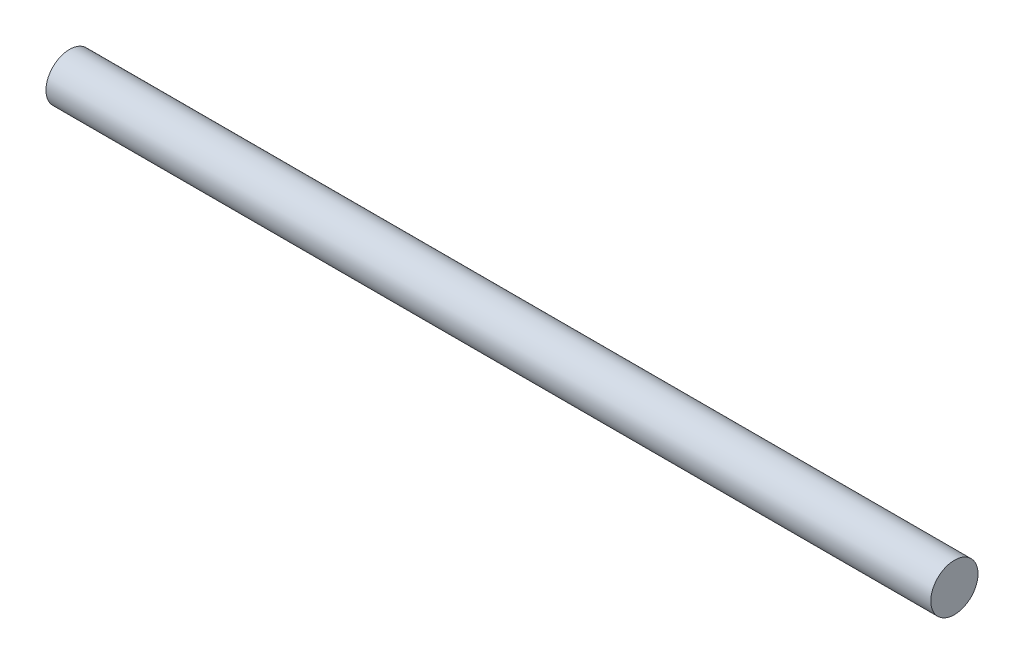
ISO-10303-21;
HEADER;
FILE_DESCRIPTION(('STEP AP214'),'2;1');
FILE_NAME('part.step','',(''),(''),'','','');
FILE_SCHEMA(('AUTOMOTIVE_DESIGN { 1 0 10303 214 1 1 1 1 }'));
ENDSEC;
DATA;
#1=APPLICATION_CONTEXT('core data for automotive mechanical design processes');
#2=APPLICATION_PROTOCOL_DEFINITION('international standard','automotive_design',2000,#1);
#3=PRODUCT_CONTEXT('',#1,'mechanical');
#4=PRODUCT('Part','Part','',(#3));
#5=PRODUCT_RELATED_PRODUCT_CATEGORY('part','',(#4));
#6=PRODUCT_DEFINITION_FORMATION('','',#4);
#7=PRODUCT_DEFINITION_CONTEXT('part definition',#1,'design');
#8=PRODUCT_DEFINITION('design','',#6,#7);
#9=PRODUCT_DEFINITION_SHAPE('','',#8);
#10=(LENGTH_UNIT() NAMED_UNIT(*) SI_UNIT(.MILLI.,.METRE.));
#11=(NAMED_UNIT(*) PLANE_ANGLE_UNIT() SI_UNIT($,.RADIAN.));
#12=(NAMED_UNIT(*) SI_UNIT($,.STERADIAN.) SOLID_ANGLE_UNIT());
#13=UNCERTAINTY_MEASURE_WITH_UNIT(LENGTH_MEASURE(1.E-05),#10,'distance_accuracy_value','');
#14=(GEOMETRIC_REPRESENTATION_CONTEXT(3) GLOBAL_UNCERTAINTY_ASSIGNED_CONTEXT((#13)) GLOBAL_UNIT_ASSIGNED_CONTEXT((#10,
#11,#12)) REPRESENTATION_CONTEXT('',''));
#15=CARTESIAN_POINT('',(0.,0.,0.));
#16=DIRECTION('',(0.,0.,1.));
#17=DIRECTION('',(1.,0.,0.));
#18=AXIS2_PLACEMENT_3D('',#15,#16,#17);
#19=CARTESIAN_POINT('',(75.,0.,0.));
#20=DIRECTION('',(-1.,0.,0.));
#21=DIRECTION('',(0.,0.,1.));
#22=AXIS2_PLACEMENT_3D('',#19,#20,#21);
#23=CYLINDRICAL_SURFACE('',#22,2.);
#24=CARTESIAN_POINT('',(75.,0.,0.));
#25=DIRECTION('',(1.,0.,0.));
#26=DIRECTION('',(0.,0.,-1.));
#27=AXIS2_PLACEMENT_3D('',#24,#25,#26);
#28=CIRCLE('',#27,2.);
#29=CARTESIAN_POINT('',(75.,0.,-2.));
#30=VERTEX_POINT('',#29);
#31=EDGE_CURVE('E10',#30,#30,#28,.T.);
#32=ORIENTED_EDGE('',*,*,#31,.F.);
#33=EDGE_LOOP('',(#32));
#34=FACE_BOUND('',#33,.T.);
#35=CARTESIAN_POINT('',(0.,0.,0.));
#36=DIRECTION('',(1.,0.,0.));
#37=DIRECTION('',(0.,0.,-1.));
#38=AXIS2_PLACEMENT_3D('',#35,#36,#37);
#39=CIRCLE('',#38,2.);
#40=CARTESIAN_POINT('',(0.,0.,-2.));
#41=VERTEX_POINT('',#40);
#42=EDGE_CURVE('E37',#41,#41,#39,.T.);
#43=ORIENTED_EDGE('',*,*,#42,.T.);
#44=EDGE_LOOP('',(#43));
#45=FACE_BOUND('',#44,.T.);
#46=ADVANCED_FACE('F34',(#34,#45),#23,.T.);
#47=CARTESIAN_POINT('',(75.,0.,0.));
#48=DIRECTION('',(1.,0.,0.));
#49=DIRECTION('',(0.,0.,-1.));
#50=AXIS2_PLACEMENT_3D('',#47,#48,#49);
#51=PLANE('',#50);
#52=ORIENTED_EDGE('',*,*,#31,.T.);
#53=EDGE_LOOP('',(#52));
#54=FACE_BOUND('',#53,.T.);
#55=ADVANCED_FACE('F49',(#54),#51,.T.);
#56=CARTESIAN_POINT('',(0.,0.,0.));
#57=DIRECTION('',(1.,0.,0.));
#58=DIRECTION('',(0.,0.,-1.));
#59=AXIS2_PLACEMENT_3D('',#56,#57,#58);
#60=PLANE('',#59);
#61=ORIENTED_EDGE('',*,*,#42,.F.);
#62=EDGE_LOOP('',(#61));
#63=FACE_BOUND('',#62,.T.);
#64=ADVANCED_FACE('F47',(#63),#60,.F.);
#65=CLOSED_SHELL('',(#46,#55,#64));
#66=MANIFOLD_SOLID_BREP('B2',#65);
#67=ADVANCED_BREP_SHAPE_REPRESENTATION('',(#18,#66),#14);
#68=SHAPE_DEFINITION_REPRESENTATION(#9,#67);
ENDSEC;
END-ISO-10303-21;
